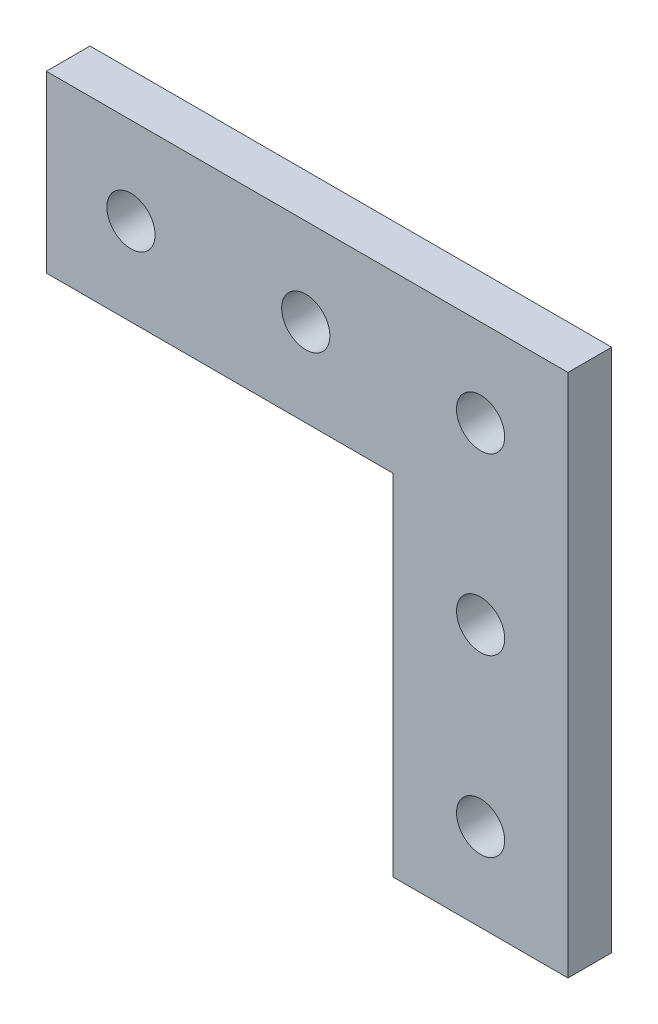
ISO-10303-21;
HEADER;
FILE_DESCRIPTION(('STEP AP214'),'2;1');
FILE_NAME('part.step','',(''),(''),'','','');
FILE_SCHEMA(('AUTOMOTIVE_DESIGN { 1 0 10303 214 1 1 1 1 }'));
ENDSEC;
DATA;
#1=APPLICATION_CONTEXT('core data for automotive mechanical design processes');
#2=APPLICATION_PROTOCOL_DEFINITION('international standard','automotive_design',2000,#1);
#3=PRODUCT_CONTEXT('',#1,'mechanical');
#4=PRODUCT('Part','Part','',(#3));
#5=PRODUCT_RELATED_PRODUCT_CATEGORY('part','',(#4));
#6=PRODUCT_DEFINITION_FORMATION('','',#4);
#7=PRODUCT_DEFINITION_CONTEXT('part definition',#1,'design');
#8=PRODUCT_DEFINITION('design','',#6,#7);
#9=PRODUCT_DEFINITION_SHAPE('','',#8);
#10=(LENGTH_UNIT() NAMED_UNIT(*) SI_UNIT(.MILLI.,.METRE.));
#11=(NAMED_UNIT(*) PLANE_ANGLE_UNIT() SI_UNIT($,.RADIAN.));
#12=(NAMED_UNIT(*) SI_UNIT($,.STERADIAN.) SOLID_ANGLE_UNIT());
#13=UNCERTAINTY_MEASURE_WITH_UNIT(LENGTH_MEASURE(1.E-05),#10,'distance_accuracy_value','');
#14=(GEOMETRIC_REPRESENTATION_CONTEXT(3) GLOBAL_UNCERTAINTY_ASSIGNED_CONTEXT((#13)) GLOBAL_UNIT_ASSIGNED_CONTEXT((#10,
#11,#12)) REPRESENTATION_CONTEXT('',''));
#15=CARTESIAN_POINT('',(0.,0.,0.));
#16=DIRECTION('',(0.,0.,1.));
#17=DIRECTION('',(1.,0.,0.));
#18=AXIS2_PLACEMENT_3D('',#15,#16,#17);
#19=CARTESIAN_POINT('',(12.7,50.8,6.35));
#20=DIRECTION('',(-1.,0.,0.));
#21=DIRECTION('',(0.,0.,1.));
#22=AXIS2_PLACEMENT_3D('',#19,#20,#21);
#23=PLANE('',#22);
#24=DIRECTION('',(0.,1.,0.));
#25=VECTOR('',#24,1.);
#26=CARTESIAN_POINT('',(12.7,50.8,0.));
#27=LINE('',#26,#25);
#28=CARTESIAN_POINT('',(12.7,0.,0.));
#29=VERTEX_POINT('',#28);
#30=CARTESIAN_POINT('',(12.7,76.2,0.));
#31=VERTEX_POINT('',#30);
#32=EDGE_CURVE('E80',#29,#31,#27,.T.);
#33=ORIENTED_EDGE('',*,*,#32,.T.);
#34=DIRECTION('',(0.,0.,-1.));
#35=VECTOR('',#34,1.);
#36=CARTESIAN_POINT('',(12.7,76.2,6.35));
#37=LINE('',#36,#35);
#38=CARTESIAN_POINT('',(12.7,76.2,6.35));
#39=VERTEX_POINT('',#38);
#40=EDGE_CURVE('E11',#39,#31,#37,.T.);
#41=ORIENTED_EDGE('',*,*,#40,.F.);
#42=DIRECTION('',(0.,1.,0.));
#43=VECTOR('',#42,1.);
#44=CARTESIAN_POINT('',(12.7,50.8,6.35));
#45=LINE('',#44,#43);
#46=CARTESIAN_POINT('',(12.7,0.,6.35));
#47=VERTEX_POINT('',#46);
#48=EDGE_CURVE('E86',#47,#39,#45,.T.);
#49=ORIENTED_EDGE('',*,*,#48,.F.);
#50=DIRECTION('',(0.,0.,-1.));
#51=VECTOR('',#50,1.);
#52=CARTESIAN_POINT('',(12.7,0.,6.35));
#53=LINE('',#52,#51);
#54=EDGE_CURVE('E114',#47,#29,#53,.T.);
#55=ORIENTED_EDGE('',*,*,#54,.T.);
#56=EDGE_LOOP('',(#33,#41,#49,#55));
#57=FACE_BOUND('',#56,.T.);
#58=ADVANCED_FACE('F34',(#57),#23,.F.);
#59=CARTESIAN_POINT('',(12.7,76.2,6.35));
#60=DIRECTION('',(0.,-1.,0.));
#61=DIRECTION('',(0.,0.,-1.));
#62=AXIS2_PLACEMENT_3D('',#59,#60,#61);
#63=PLANE('',#62);
#64=DIRECTION('',(-1.,0.,0.));
#65=VECTOR('',#64,1.);
#66=CARTESIAN_POINT('',(12.7,76.2,0.));
#67=LINE('',#66,#65);
#68=CARTESIAN_POINT('',(-63.1,76.2,0.));
#69=VERTEX_POINT('',#68);
#70=EDGE_CURVE('E119',#31,#69,#67,.T.);
#71=ORIENTED_EDGE('',*,*,#70,.T.);
#72=DIRECTION('',(0.,0.,-1.));
#73=VECTOR('',#72,1.);
#74=CARTESIAN_POINT('',(-63.1,76.2,6.35));
#75=LINE('',#74,#73);
#76=CARTESIAN_POINT('',(-63.1,76.2,6.35));
#77=VERTEX_POINT('',#76);
#78=EDGE_CURVE('E42',#77,#69,#75,.T.);
#79=ORIENTED_EDGE('',*,*,#78,.F.);
#80=DIRECTION('',(-1.,0.,0.));
#81=VECTOR('',#80,1.);
#82=CARTESIAN_POINT('',(12.7,76.2,6.35));
#83=LINE('',#82,#81);
#84=EDGE_CURVE('E142',#39,#77,#83,.T.);
#85=ORIENTED_EDGE('',*,*,#84,.F.);
#86=ORIENTED_EDGE('',*,*,#40,.T.);
#87=EDGE_LOOP('',(#71,#79,#85,#86));
#88=FACE_BOUND('',#87,.T.);
#89=ADVANCED_FACE('F211',(#88),#63,.F.);
#90=CARTESIAN_POINT('',(-63.1,76.2,6.35));
#91=DIRECTION('',(1.,0.,0.));
#92=DIRECTION('',(0.,0.,-1.));
#93=AXIS2_PLACEMENT_3D('',#90,#91,#92);
#94=PLANE('',#93);
#95=DIRECTION('',(0.,-1.,0.));
#96=VECTOR('',#95,1.);
#97=CARTESIAN_POINT('',(-63.1,76.2,0.));
#98=LINE('',#97,#96);
#99=CARTESIAN_POINT('',(-63.1,50.8,0.));
#100=VERTEX_POINT('',#99);
#101=EDGE_CURVE('E122',#69,#100,#98,.T.);
#102=ORIENTED_EDGE('',*,*,#101,.T.);
#103=DIRECTION('',(0.,0.,-1.));
#104=VECTOR('',#103,1.);
#105=CARTESIAN_POINT('',(-63.1,50.8,6.35));
#106=LINE('',#105,#104);
#107=CARTESIAN_POINT('',(-63.1,50.8,6.35));
#108=VERTEX_POINT('',#107);
#109=EDGE_CURVE('E109',#108,#100,#106,.T.);
#110=ORIENTED_EDGE('',*,*,#109,.F.);
#111=DIRECTION('',(0.,-1.,0.));
#112=VECTOR('',#111,1.);
#113=CARTESIAN_POINT('',(-63.1,76.2,6.35));
#114=LINE('',#113,#112);
#115=EDGE_CURVE('E100',#77,#108,#114,.T.);
#116=ORIENTED_EDGE('',*,*,#115,.F.);
#117=ORIENTED_EDGE('',*,*,#78,.T.);
#118=EDGE_LOOP('',(#102,#110,#116,#117));
#119=FACE_BOUND('',#118,.T.);
#120=ADVANCED_FACE('F135',(#119),#94,.F.);
#121=CARTESIAN_POINT('',(-63.1,50.8,6.35));
#122=DIRECTION('',(0.,1.,0.));
#123=DIRECTION('',(0.,0.,1.));
#124=AXIS2_PLACEMENT_3D('',#121,#122,#123);
#125=PLANE('',#124);
#126=DIRECTION('',(1.,0.,0.));
#127=VECTOR('',#126,1.);
#128=CARTESIAN_POINT('',(-63.1,50.8,0.));
#129=LINE('',#128,#127);
#130=CARTESIAN_POINT('',(-12.7,50.8,0.));
#131=VERTEX_POINT('',#130);
#132=EDGE_CURVE('E108',#100,#131,#129,.T.);
#133=ORIENTED_EDGE('',*,*,#132,.T.);
#134=DIRECTION('',(0.,0.,-1.));
#135=VECTOR('',#134,1.);
#136=CARTESIAN_POINT('',(-12.7,50.8,6.35));
#137=LINE('',#136,#135);
#138=CARTESIAN_POINT('',(-12.7,50.8,6.35));
#139=VERTEX_POINT('',#138);
#140=EDGE_CURVE('E105',#139,#131,#137,.T.);
#141=ORIENTED_EDGE('',*,*,#140,.F.);
#142=DIRECTION('',(1.,0.,0.));
#143=VECTOR('',#142,1.);
#144=CARTESIAN_POINT('',(-63.1,50.8,6.35));
#145=LINE('',#144,#143);
#146=EDGE_CURVE('E94',#108,#139,#145,.T.);
#147=ORIENTED_EDGE('',*,*,#146,.F.);
#148=ORIENTED_EDGE('',*,*,#109,.T.);
#149=EDGE_LOOP('',(#133,#141,#147,#148));
#150=FACE_BOUND('',#149,.T.);
#151=ADVANCED_FACE('F106',(#150),#125,.F.);
#152=CARTESIAN_POINT('',(-12.7,0.,6.35));
#153=DIRECTION('',(1.,0.,0.));
#154=DIRECTION('',(0.,0.,-1.));
#155=AXIS2_PLACEMENT_3D('',#152,#153,#154);
#156=PLANE('',#155);
#157=DIRECTION('',(0.,-1.,0.));
#158=VECTOR('',#157,1.);
#159=CARTESIAN_POINT('',(-12.7,0.,0.));
#160=LINE('',#159,#158);
#161=CARTESIAN_POINT('',(-12.7,0.,0.));
#162=VERTEX_POINT('',#161);
#163=EDGE_CURVE('E73',#131,#162,#160,.T.);
#164=ORIENTED_EDGE('',*,*,#163,.T.);
#165=DIRECTION('',(0.,0.,-1.));
#166=VECTOR('',#165,1.);
#167=CARTESIAN_POINT('',(-12.7,0.,6.35));
#168=LINE('',#167,#166);
#169=CARTESIAN_POINT('',(-12.7,0.,6.35));
#170=VERTEX_POINT('',#169);
#171=EDGE_CURVE('E110',#170,#162,#168,.T.);
#172=ORIENTED_EDGE('',*,*,#171,.F.);
#173=DIRECTION('',(0.,-1.,0.));
#174=VECTOR('',#173,1.);
#175=CARTESIAN_POINT('',(-12.7,0.,6.35));
#176=LINE('',#175,#174);
#177=EDGE_CURVE('E98',#139,#170,#176,.T.);
#178=ORIENTED_EDGE('',*,*,#177,.F.);
#179=ORIENTED_EDGE('',*,*,#140,.T.);
#180=EDGE_LOOP('',(#164,#172,#178,#179));
#181=FACE_BOUND('',#180,.T.);
#182=ADVANCED_FACE('F112',(#181),#156,.F.);
#183=CARTESIAN_POINT('',(12.7,0.,6.35));
#184=DIRECTION('',(0.,1.,0.));
#185=DIRECTION('',(-1.,0.,0.));
#186=AXIS2_PLACEMENT_3D('',#183,#184,#185);
#187=PLANE('',#186);
#188=DIRECTION('',(1.,0.,0.));
#189=VECTOR('',#188,1.);
#190=CARTESIAN_POINT('',(12.7,0.,0.));
#191=LINE('',#190,#189);
#192=EDGE_CURVE('E126',#162,#29,#191,.T.);
#193=ORIENTED_EDGE('',*,*,#192,.T.);
#194=ORIENTED_EDGE('',*,*,#54,.F.);
#195=DIRECTION('',(1.,0.,0.));
#196=VECTOR('',#195,1.);
#197=CARTESIAN_POINT('',(12.7,0.,6.35));
#198=LINE('',#197,#196);
#199=EDGE_CURVE('E50',#170,#47,#198,.T.);
#200=ORIENTED_EDGE('',*,*,#199,.F.);
#201=ORIENTED_EDGE('',*,*,#171,.T.);
#202=EDGE_LOOP('',(#193,#194,#200,#201));
#203=FACE_BOUND('',#202,.T.);
#204=ADVANCED_FACE('F140',(#203),#187,.F.);
#205=CARTESIAN_POINT('',(0.,0.,6.35));
#206=DIRECTION('',(0.,0.,-1.));
#207=DIRECTION('',(-1.,0.,0.));
#208=AXIS2_PLACEMENT_3D('',#205,#206,#207);
#209=PLANE('',#208);
#210=CARTESIAN_POINT('',(-50.8,63.5,6.35));
#211=DIRECTION('',(0.,0.,1.));
#212=DIRECTION('',(1.,0.,0.));
#213=AXIS2_PLACEMENT_3D('',#210,#211,#212);
#214=CIRCLE('',#213,3.5);
#215=CARTESIAN_POINT('',(-47.3,63.5,6.35));
#216=VERTEX_POINT('',#215);
#217=EDGE_CURVE('E170',#216,#216,#214,.T.);
#218=ORIENTED_EDGE('',*,*,#217,.F.);
#219=EDGE_LOOP('',(#218));
#220=FACE_BOUND('',#219,.T.);
#221=CARTESIAN_POINT('',(0.,63.5,6.35));
#222=DIRECTION('',(0.,0.,1.));
#223=DIRECTION('',(1.,0.,0.));
#224=AXIS2_PLACEMENT_3D('',#221,#222,#223);
#225=CIRCLE('',#224,3.5);
#226=CARTESIAN_POINT('',(3.5,63.5,6.35));
#227=VERTEX_POINT('',#226);
#228=EDGE_CURVE('E164',#227,#227,#225,.T.);
#229=ORIENTED_EDGE('',*,*,#228,.F.);
#230=EDGE_LOOP('',(#229));
#231=FACE_BOUND('',#230,.T.);
#232=CARTESIAN_POINT('',(-25.4,63.5,6.35));
#233=DIRECTION('',(0.,0.,1.));
#234=DIRECTION('',(1.,0.,0.));
#235=AXIS2_PLACEMENT_3D('',#232,#233,#234);
#236=CIRCLE('',#235,3.5);
#237=CARTESIAN_POINT('',(-21.9,63.5,6.35));
#238=VERTEX_POINT('',#237);
#239=EDGE_CURVE('E158',#238,#238,#236,.T.);
#240=ORIENTED_EDGE('',*,*,#239,.F.);
#241=EDGE_LOOP('',(#240));
#242=FACE_BOUND('',#241,.T.);
#243=CARTESIAN_POINT('',(0.,38.1,6.35));
#244=DIRECTION('',(0.,0.,1.));
#245=DIRECTION('',(1.,0.,0.));
#246=AXIS2_PLACEMENT_3D('',#243,#244,#245);
#247=CIRCLE('',#246,3.5);
#248=CARTESIAN_POINT('',(3.5,38.1,6.35));
#249=VERTEX_POINT('',#248);
#250=EDGE_CURVE('E152',#249,#249,#247,.T.);
#251=ORIENTED_EDGE('',*,*,#250,.F.);
#252=EDGE_LOOP('',(#251));
#253=FACE_BOUND('',#252,.T.);
#254=CARTESIAN_POINT('',(0.,12.7,6.35));
#255=DIRECTION('',(0.,0.,1.));
#256=DIRECTION('',(1.,0.,0.));
#257=AXIS2_PLACEMENT_3D('',#254,#255,#256);
#258=CIRCLE('',#257,3.5);
#259=CARTESIAN_POINT('',(3.5,12.7,6.35));
#260=VERTEX_POINT('',#259);
#261=EDGE_CURVE('E146',#260,#260,#258,.T.);
#262=ORIENTED_EDGE('',*,*,#261,.F.);
#263=EDGE_LOOP('',(#262));
#264=FACE_BOUND('',#263,.T.);
#265=ORIENTED_EDGE('',*,*,#48,.T.);
#266=ORIENTED_EDGE('',*,*,#84,.T.);
#267=ORIENTED_EDGE('',*,*,#115,.T.);
#268=ORIENTED_EDGE('',*,*,#146,.T.);
#269=ORIENTED_EDGE('',*,*,#177,.T.);
#270=ORIENTED_EDGE('',*,*,#199,.T.);
#271=EDGE_LOOP('',(#265,#266,#267,#268,#269,#270));
#272=FACE_BOUND('',#271,.T.);
#273=ADVANCED_FACE('F96',(#220,#231,#242,#253,#264,#272),#209,.F.);
#274=CARTESIAN_POINT('',(0.,0.,0.));
#275=DIRECTION('',(0.,0.,-1.));
#276=DIRECTION('',(-1.,0.,0.));
#277=AXIS2_PLACEMENT_3D('',#274,#275,#276);
#278=PLANE('',#277);
#279=CARTESIAN_POINT('',(-50.8,63.5,0.));
#280=DIRECTION('',(0.,0.,1.));
#281=DIRECTION('',(1.,0.,0.));
#282=AXIS2_PLACEMENT_3D('',#279,#280,#281);
#283=CIRCLE('',#282,3.5);
#284=CARTESIAN_POINT('',(-47.3,63.5,0.));
#285=VERTEX_POINT('',#284);
#286=EDGE_CURVE('E120',#285,#285,#283,.T.);
#287=ORIENTED_EDGE('',*,*,#286,.T.);
#288=EDGE_LOOP('',(#287));
#289=FACE_BOUND('',#288,.T.);
#290=CARTESIAN_POINT('',(0.,63.5,0.));
#291=DIRECTION('',(0.,0.,1.));
#292=DIRECTION('',(1.,0.,0.));
#293=AXIS2_PLACEMENT_3D('',#290,#291,#292);
#294=CIRCLE('',#293,3.5);
#295=CARTESIAN_POINT('',(3.5,63.5,0.));
#296=VERTEX_POINT('',#295);
#297=EDGE_CURVE('E167',#296,#296,#294,.T.);
#298=ORIENTED_EDGE('',*,*,#297,.T.);
#299=EDGE_LOOP('',(#298));
#300=FACE_BOUND('',#299,.T.);
#301=CARTESIAN_POINT('',(-25.4,63.5,0.));
#302=DIRECTION('',(0.,0.,1.));
#303=DIRECTION('',(1.,0.,0.));
#304=AXIS2_PLACEMENT_3D('',#301,#302,#303);
#305=CIRCLE('',#304,3.5);
#306=CARTESIAN_POINT('',(-21.9,63.5,0.));
#307=VERTEX_POINT('',#306);
#308=EDGE_CURVE('E161',#307,#307,#305,.T.);
#309=ORIENTED_EDGE('',*,*,#308,.T.);
#310=EDGE_LOOP('',(#309));
#311=FACE_BOUND('',#310,.T.);
#312=CARTESIAN_POINT('',(0.,38.1,0.));
#313=DIRECTION('',(0.,0.,1.));
#314=DIRECTION('',(1.,0.,0.));
#315=AXIS2_PLACEMENT_3D('',#312,#313,#314);
#316=CIRCLE('',#315,3.5);
#317=CARTESIAN_POINT('',(3.5,38.1,0.));
#318=VERTEX_POINT('',#317);
#319=EDGE_CURVE('E155',#318,#318,#316,.T.);
#320=ORIENTED_EDGE('',*,*,#319,.T.);
#321=EDGE_LOOP('',(#320));
#322=FACE_BOUND('',#321,.T.);
#323=CARTESIAN_POINT('',(0.,12.7,0.));
#324=DIRECTION('',(0.,0.,1.));
#325=DIRECTION('',(1.,0.,0.));
#326=AXIS2_PLACEMENT_3D('',#323,#324,#325);
#327=CIRCLE('',#326,3.5);
#328=CARTESIAN_POINT('',(3.5,12.7,0.));
#329=VERTEX_POINT('',#328);
#330=EDGE_CURVE('E149',#329,#329,#327,.T.);
#331=ORIENTED_EDGE('',*,*,#330,.T.);
#332=EDGE_LOOP('',(#331));
#333=FACE_BOUND('',#332,.T.);
#334=ORIENTED_EDGE('',*,*,#32,.F.);
#335=ORIENTED_EDGE('',*,*,#192,.F.);
#336=ORIENTED_EDGE('',*,*,#163,.F.);
#337=ORIENTED_EDGE('',*,*,#132,.F.);
#338=ORIENTED_EDGE('',*,*,#101,.F.);
#339=ORIENTED_EDGE('',*,*,#70,.F.);
#340=EDGE_LOOP('',(#334,#335,#336,#337,#338,#339));
#341=FACE_BOUND('',#340,.T.);
#342=ADVANCED_FACE('F138',(#289,#300,#311,#322,#333,#341),#278,.T.);
#343=CARTESIAN_POINT('',(0.,12.7,0.));
#344=DIRECTION('',(0.,0.,1.));
#345=DIRECTION('',(1.,0.,0.));
#346=AXIS2_PLACEMENT_3D('',#343,#344,#345);
#347=CYLINDRICAL_SURFACE('',#346,3.5);
#348=ORIENTED_EDGE('',*,*,#330,.F.);
#349=EDGE_LOOP('',(#348));
#350=FACE_BOUND('',#349,.T.);
#351=ORIENTED_EDGE('',*,*,#261,.T.);
#352=EDGE_LOOP('',(#351));
#353=FACE_BOUND('',#352,.T.);
#354=ADVANCED_FACE('F196',(#350,#353),#347,.F.);
#355=CARTESIAN_POINT('',(0.,38.1,0.));
#356=DIRECTION('',(0.,0.,1.));
#357=DIRECTION('',(1.,0.,0.));
#358=AXIS2_PLACEMENT_3D('',#355,#356,#357);
#359=CYLINDRICAL_SURFACE('',#358,3.5);
#360=ORIENTED_EDGE('',*,*,#319,.F.);
#361=EDGE_LOOP('',(#360));
#362=FACE_BOUND('',#361,.T.);
#363=ORIENTED_EDGE('',*,*,#250,.T.);
#364=EDGE_LOOP('',(#363));
#365=FACE_BOUND('',#364,.T.);
#366=ADVANCED_FACE('F198',(#362,#365),#359,.F.);
#367=CARTESIAN_POINT('',(-25.4,63.5,0.));
#368=DIRECTION('',(0.,0.,1.));
#369=DIRECTION('',(1.,0.,0.));
#370=AXIS2_PLACEMENT_3D('',#367,#368,#369);
#371=CYLINDRICAL_SURFACE('',#370,3.5);
#372=ORIENTED_EDGE('',*,*,#308,.F.);
#373=EDGE_LOOP('',(#372));
#374=FACE_BOUND('',#373,.T.);
#375=ORIENTED_EDGE('',*,*,#239,.T.);
#376=EDGE_LOOP('',(#375));
#377=FACE_BOUND('',#376,.T.);
#378=ADVANCED_FACE('F205',(#374,#377),#371,.F.);
#379=CARTESIAN_POINT('',(0.,63.5,0.));
#380=DIRECTION('',(0.,0.,1.));
#381=DIRECTION('',(1.,0.,0.));
#382=AXIS2_PLACEMENT_3D('',#379,#380,#381);
#383=CYLINDRICAL_SURFACE('',#382,3.5);
#384=ORIENTED_EDGE('',*,*,#297,.F.);
#385=EDGE_LOOP('',(#384));
#386=FACE_BOUND('',#385,.T.);
#387=ORIENTED_EDGE('',*,*,#228,.T.);
#388=EDGE_LOOP('',(#387));
#389=FACE_BOUND('',#388,.T.);
#390=ADVANCED_FACE('F181',(#386,#389),#383,.F.);
#391=CARTESIAN_POINT('',(-50.8,63.5,0.));
#392=DIRECTION('',(0.,0.,1.));
#393=DIRECTION('',(1.,0.,0.));
#394=AXIS2_PLACEMENT_3D('',#391,#392,#393);
#395=CYLINDRICAL_SURFACE('',#394,3.5);
#396=ORIENTED_EDGE('',*,*,#286,.F.);
#397=EDGE_LOOP('',(#396));
#398=FACE_BOUND('',#397,.T.);
#399=ORIENTED_EDGE('',*,*,#217,.T.);
#400=EDGE_LOOP('',(#399));
#401=FACE_BOUND('',#400,.T.);
#402=ADVANCED_FACE('F178',(#398,#401),#395,.F.);
#403=CLOSED_SHELL('',(#58,#89,#120,#151,#182,#204,#273,#342,#354,#366,#378,#390,#402));
#404=MANIFOLD_SOLID_BREP('B2',#403);
#405=ADVANCED_BREP_SHAPE_REPRESENTATION('',(#18,#404),#14);
#406=SHAPE_DEFINITION_REPRESENTATION(#9,#405);
ENDSEC;
END-ISO-10303-21;
